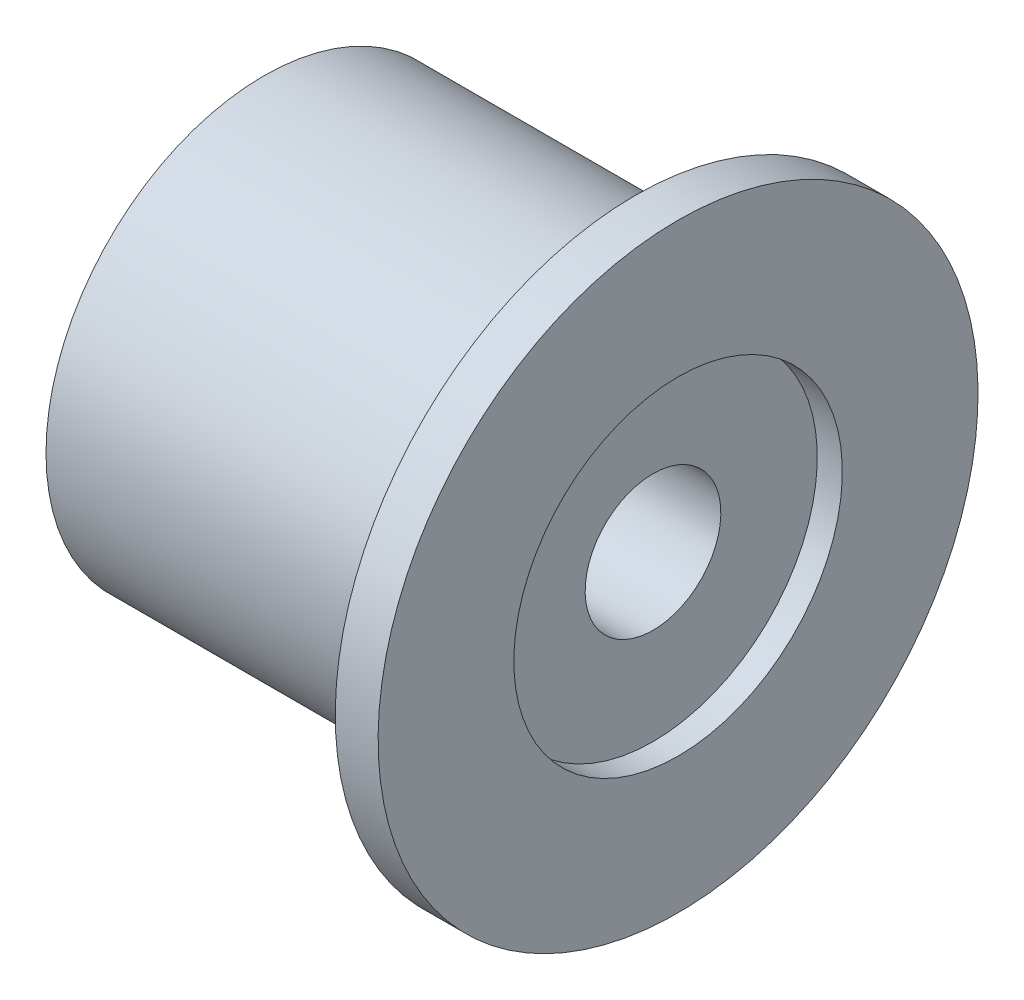
ISO-10303-21;
HEADER;
FILE_DESCRIPTION(('STEP AP214'),'2;1');
FILE_NAME('part.step','',(''),(''),'','','');
FILE_SCHEMA(('AUTOMOTIVE_DESIGN { 1 0 10303 214 1 1 1 1 }'));
ENDSEC;
DATA;
#1=APPLICATION_CONTEXT('core data for automotive mechanical design processes');
#2=APPLICATION_PROTOCOL_DEFINITION('international standard','automotive_design',2000,#1);
#3=PRODUCT_CONTEXT('',#1,'mechanical');
#4=PRODUCT('Part','Part','',(#3));
#5=PRODUCT_RELATED_PRODUCT_CATEGORY('part','',(#4));
#6=PRODUCT_DEFINITION_FORMATION('','',#4);
#7=PRODUCT_DEFINITION_CONTEXT('part definition',#1,'design');
#8=PRODUCT_DEFINITION('design','',#6,#7);
#9=PRODUCT_DEFINITION_SHAPE('','',#8);
#10=(LENGTH_UNIT() NAMED_UNIT(*) SI_UNIT(.MILLI.,.METRE.));
#11=(NAMED_UNIT(*) PLANE_ANGLE_UNIT() SI_UNIT($,.RADIAN.));
#12=(NAMED_UNIT(*) SI_UNIT($,.STERADIAN.) SOLID_ANGLE_UNIT());
#13=UNCERTAINTY_MEASURE_WITH_UNIT(LENGTH_MEASURE(1.E-05),#10,'distance_accuracy_value','');
#14=(GEOMETRIC_REPRESENTATION_CONTEXT(3) GLOBAL_UNCERTAINTY_ASSIGNED_CONTEXT((#13)) GLOBAL_UNIT_ASSIGNED_CONTEXT((#10,
#11,#12)) REPRESENTATION_CONTEXT('',''));
#15=CARTESIAN_POINT('',(0.,0.,0.));
#16=DIRECTION('',(0.,0.,1.));
#17=DIRECTION('',(1.,0.,0.));
#18=AXIS2_PLACEMENT_3D('',#15,#16,#17);
#19=CARTESIAN_POINT('',(-2.032,7.747,0.));
#20=DIRECTION('',(-1.,0.,0.));
#21=DIRECTION('',(0.,-1.,0.));
#22=AXIS2_PLACEMENT_3D('',#19,#20,#21);
#23=PLANE('',#22);
#24=CARTESIAN_POINT('',(-2.03199999999999,0.,0.));
#25=DIRECTION('',(1.,0.,0.));
#26=DIRECTION('',(0.,1.,0.));
#27=AXIS2_PLACEMENT_3D('',#24,#25,#26);
#28=CIRCLE('',#27,7.747);
#29=CARTESIAN_POINT('',(-2.03199999999999,7.747,0.));
#30=VERTEX_POINT('',#29);
#31=EDGE_CURVE('E62',#30,#30,#28,.T.);
#32=ORIENTED_EDGE('',*,*,#31,.T.);
#33=EDGE_LOOP('',(#32));
#34=FACE_BOUND('',#33,.T.);
#35=CARTESIAN_POINT('',(-2.032,0.,0.));
#36=DIRECTION('',(1.,0.,0.));
#37=DIRECTION('',(0.,1.,0.));
#38=AXIS2_PLACEMENT_3D('',#35,#36,#37);
#39=CIRCLE('',#38,10.668);
#40=CARTESIAN_POINT('',(-2.032,10.668,0.));
#41=VERTEX_POINT('',#40);
#42=EDGE_CURVE('E10',#41,#41,#39,.T.);
#43=ORIENTED_EDGE('',*,*,#42,.F.);
#44=EDGE_LOOP('',(#43));
#45=FACE_BOUND('',#44,.T.);
#46=ADVANCED_FACE('F31',(#34,#45),#23,.T.);
#47=CARTESIAN_POINT('',(0.,0.,0.));
#48=DIRECTION('',(1.,0.,0.));
#49=DIRECTION('',(0.,1.,0.));
#50=AXIS2_PLACEMENT_3D('',#47,#48,#49);
#51=CYLINDRICAL_SURFACE('',#50,10.668);
#52=ORIENTED_EDGE('',*,*,#42,.T.);
#53=EDGE_LOOP('',(#52));
#54=FACE_BOUND('',#53,.T.);
#55=CARTESIAN_POINT('',(-0.507999999999997,0.,0.));
#56=DIRECTION('',(1.,0.,0.));
#57=DIRECTION('',(0.,1.,0.));
#58=AXIS2_PLACEMENT_3D('',#55,#56,#57);
#59=CIRCLE('',#58,10.668);
#60=CARTESIAN_POINT('',(-0.508,10.668,0.));
#61=VERTEX_POINT('',#60);
#62=EDGE_CURVE('E37',#61,#61,#59,.T.);
#63=ORIENTED_EDGE('',*,*,#62,.F.);
#64=EDGE_LOOP('',(#63));
#65=FACE_BOUND('',#64,.T.);
#66=ADVANCED_FACE('F80',(#54,#65),#51,.T.);
#67=CARTESIAN_POINT('',(-0.508,10.668,0.));
#68=DIRECTION('',(1.,0.,0.));
#69=DIRECTION('',(0.,1.,0.));
#70=AXIS2_PLACEMENT_3D('',#67,#68,#69);
#71=PLANE('',#70);
#72=ORIENTED_EDGE('',*,*,#62,.T.);
#73=EDGE_LOOP('',(#72));
#74=FACE_BOUND('',#73,.T.);
#75=CARTESIAN_POINT('',(-0.507999999999998,0.,0.));
#76=DIRECTION('',(1.,0.,0.));
#77=DIRECTION('',(0.,1.,0.));
#78=AXIS2_PLACEMENT_3D('',#75,#76,#77);
#79=CIRCLE('',#78,5.842);
#80=CARTESIAN_POINT('',(-0.507999999999999,5.842,0.));
#81=VERTEX_POINT('',#80);
#82=EDGE_CURVE('E41',#81,#81,#79,.T.);
#83=ORIENTED_EDGE('',*,*,#82,.F.);
#84=EDGE_LOOP('',(#83));
#85=FACE_BOUND('',#84,.T.);
#86=ADVANCED_FACE('F84',(#74,#85),#71,.T.);
#87=CARTESIAN_POINT('',(0.,0.,0.));
#88=DIRECTION('',(1.,0.,0.));
#89=DIRECTION('',(0.,1.,0.));
#90=AXIS2_PLACEMENT_3D('',#87,#88,#89);
#91=CYLINDRICAL_SURFACE('',#90,5.842);
#92=ORIENTED_EDGE('',*,*,#82,.T.);
#93=EDGE_LOOP('',(#92));
#94=FACE_BOUND('',#93,.T.);
#95=CARTESIAN_POINT('',(-1.39999999995788,0.,0.));
#96=DIRECTION('',(1.,0.,0.));
#97=DIRECTION('',(0.,1.,0.));
#98=AXIS2_PLACEMENT_3D('',#95,#96,#97);
#99=CIRCLE('',#98,5.842);
#100=CARTESIAN_POINT('',(-1.39999999995788,5.842,0.));
#101=VERTEX_POINT('',#100);
#102=EDGE_CURVE('E45',#101,#101,#99,.T.);
#103=ORIENTED_EDGE('',*,*,#102,.F.);
#104=EDGE_LOOP('',(#103));
#105=FACE_BOUND('',#104,.T.);
#106=ADVANCED_FACE('F88',(#94,#105),#91,.F.);
#107=CARTESIAN_POINT('',(-1.39999999995788,2.413,0.));
#108=DIRECTION('',(1.,0.,0.));
#109=DIRECTION('',(0.,1.,0.));
#110=AXIS2_PLACEMENT_3D('',#107,#108,#109);
#111=PLANE('',#110);
#112=ORIENTED_EDGE('',*,*,#102,.T.);
#113=EDGE_LOOP('',(#112));
#114=FACE_BOUND('',#113,.T.);
#115=CARTESIAN_POINT('',(-1.39999999995788,0.,0.));
#116=DIRECTION('',(1.,0.,0.));
#117=DIRECTION('',(0.,1.,0.));
#118=AXIS2_PLACEMENT_3D('',#115,#116,#117);
#119=CIRCLE('',#118,2.413);
#120=CARTESIAN_POINT('',(-1.39999999995788,2.413,0.));
#121=VERTEX_POINT('',#120);
#122=EDGE_CURVE('E50',#121,#121,#119,.T.);
#123=ORIENTED_EDGE('',*,*,#122,.F.);
#124=EDGE_LOOP('',(#123));
#125=FACE_BOUND('',#124,.T.);
#126=ADVANCED_FACE('F94',(#114,#125),#111,.T.);
#127=CARTESIAN_POINT('',(0.,0.,0.));
#128=DIRECTION('',(1.,0.,0.));
#129=DIRECTION('',(0.,1.,0.));
#130=AXIS2_PLACEMENT_3D('',#127,#128,#129);
#131=CYLINDRICAL_SURFACE('',#130,2.413);
#132=ORIENTED_EDGE('',*,*,#122,.T.);
#133=EDGE_LOOP('',(#132));
#134=FACE_BOUND('',#133,.T.);
#135=CARTESIAN_POINT('',(-10.922,0.,0.));
#136=DIRECTION('',(1.,0.,0.));
#137=DIRECTION('',(0.,1.,0.));
#138=AXIS2_PLACEMENT_3D('',#135,#136,#137);
#139=CIRCLE('',#138,2.413);
#140=CARTESIAN_POINT('',(-10.922,2.413,0.));
#141=VERTEX_POINT('',#140);
#142=EDGE_CURVE('E53',#141,#141,#139,.T.);
#143=ORIENTED_EDGE('',*,*,#142,.F.);
#144=EDGE_LOOP('',(#143));
#145=FACE_BOUND('',#144,.T.);
#146=ADVANCED_FACE('F98',(#134,#145),#131,.F.);
#147=CARTESIAN_POINT('',(-15.24,0.,0.));
#148=DIRECTION('',(-1.,0.,0.));
#149=DIRECTION('',(0.,-1.,0.));
#150=AXIS2_PLACEMENT_3D('',#147,#148,#149);
#151=CONICAL_SURFACE('',#150,6.731,0.78539816339745);
#152=ORIENTED_EDGE('',*,*,#142,.T.);
#153=EDGE_LOOP('',(#152));
#154=FACE_BOUND('',#153,.T.);
#155=CARTESIAN_POINT('',(-15.24,0.,0.));
#156=DIRECTION('',(1.,0.,0.));
#157=DIRECTION('',(0.,1.,0.));
#158=AXIS2_PLACEMENT_3D('',#155,#156,#157);
#159=CIRCLE('',#158,6.731);
#160=CARTESIAN_POINT('',(-15.24,6.731,0.));
#161=VERTEX_POINT('',#160);
#162=EDGE_CURVE('E56',#161,#161,#159,.T.);
#163=ORIENTED_EDGE('',*,*,#162,.F.);
#164=EDGE_LOOP('',(#163));
#165=FACE_BOUND('',#164,.T.);
#166=ADVANCED_FACE('F76',(#154,#165),#151,.F.);
#167=CARTESIAN_POINT('',(-15.24,7.747,0.));
#168=DIRECTION('',(-1.,0.,0.));
#169=DIRECTION('',(0.,-1.,0.));
#170=AXIS2_PLACEMENT_3D('',#167,#168,#169);
#171=PLANE('',#170);
#172=ORIENTED_EDGE('',*,*,#162,.T.);
#173=EDGE_LOOP('',(#172));
#174=FACE_BOUND('',#173,.T.);
#175=CARTESIAN_POINT('',(-15.24,0.,0.));
#176=DIRECTION('',(1.,0.,0.));
#177=DIRECTION('',(0.,1.,0.));
#178=AXIS2_PLACEMENT_3D('',#175,#176,#177);
#179=CIRCLE('',#178,7.747);
#180=CARTESIAN_POINT('',(-15.24,7.747,0.));
#181=VERTEX_POINT('',#180);
#182=EDGE_CURVE('E59',#181,#181,#179,.T.);
#183=ORIENTED_EDGE('',*,*,#182,.F.);
#184=EDGE_LOOP('',(#183));
#185=FACE_BOUND('',#184,.T.);
#186=ADVANCED_FACE('F70',(#174,#185),#171,.T.);
#187=CARTESIAN_POINT('',(0.,0.,0.));
#188=DIRECTION('',(1.,0.,0.));
#189=DIRECTION('',(0.,1.,0.));
#190=AXIS2_PLACEMENT_3D('',#187,#188,#189);
#191=CYLINDRICAL_SURFACE('',#190,7.747);
#192=ORIENTED_EDGE('',*,*,#182,.T.);
#193=EDGE_LOOP('',(#192));
#194=FACE_BOUND('',#193,.T.);
#195=ORIENTED_EDGE('',*,*,#31,.F.);
#196=EDGE_LOOP('',(#195));
#197=FACE_BOUND('',#196,.T.);
#198=ADVANCED_FACE('F68',(#194,#197),#191,.T.);
#199=CLOSED_SHELL('',(#46,#66,#86,#106,#126,#146,#166,#186,#198));
#200=MANIFOLD_SOLID_BREP('B2',#199);
#201=ADVANCED_BREP_SHAPE_REPRESENTATION('',(#18,#200),#14);
#202=SHAPE_DEFINITION_REPRESENTATION(#9,#201);
ENDSEC;
END-ISO-10303-21;
